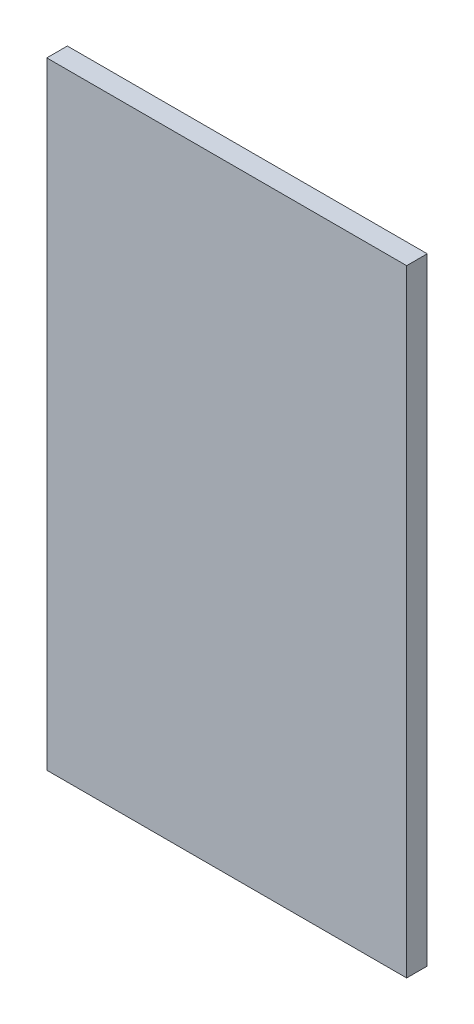
ISO-10303-21;
HEADER;
FILE_DESCRIPTION(('STEP AP214'),'2;1');
FILE_NAME('part.step','',(''),(''),'','','');
FILE_SCHEMA(('AUTOMOTIVE_DESIGN { 1 0 10303 214 1 1 1 1 }'));
ENDSEC;
DATA;
#1=APPLICATION_CONTEXT('core data for automotive mechanical design processes');
#2=APPLICATION_PROTOCOL_DEFINITION('international standard','automotive_design',2000,#1);
#3=PRODUCT_CONTEXT('',#1,'mechanical');
#4=PRODUCT('Part','Part','',(#3));
#5=PRODUCT_RELATED_PRODUCT_CATEGORY('part','',(#4));
#6=PRODUCT_DEFINITION_FORMATION('','',#4);
#7=PRODUCT_DEFINITION_CONTEXT('part definition',#1,'design');
#8=PRODUCT_DEFINITION('design','',#6,#7);
#9=PRODUCT_DEFINITION_SHAPE('','',#8);
#10=(LENGTH_UNIT() NAMED_UNIT(*) SI_UNIT(.MILLI.,.METRE.));
#11=(NAMED_UNIT(*) PLANE_ANGLE_UNIT() SI_UNIT($,.RADIAN.));
#12=(NAMED_UNIT(*) SI_UNIT($,.STERADIAN.) SOLID_ANGLE_UNIT());
#13=UNCERTAINTY_MEASURE_WITH_UNIT(LENGTH_MEASURE(1.E-05),#10,'distance_accuracy_value','');
#14=(GEOMETRIC_REPRESENTATION_CONTEXT(3) GLOBAL_UNCERTAINTY_ASSIGNED_CONTEXT((#13)) GLOBAL_UNIT_ASSIGNED_CONTEXT((#10,
#11,#12)) REPRESENTATION_CONTEXT('',''));
#15=CARTESIAN_POINT('',(0.,0.,0.));
#16=DIRECTION('',(0.,0.,1.));
#17=DIRECTION('',(1.,0.,0.));
#18=AXIS2_PLACEMENT_3D('',#15,#16,#17);
#19=CARTESIAN_POINT('',(87.5,150.,10.));
#20=DIRECTION('',(0.,-1.,0.));
#21=DIRECTION('',(0.,0.,-1.));
#22=AXIS2_PLACEMENT_3D('',#19,#20,#21);
#23=PLANE('',#22);
#24=DIRECTION('',(-1.,0.,0.));
#25=VECTOR('',#24,1.);
#26=CARTESIAN_POINT('',(87.5,150.,0.));
#27=LINE('',#26,#25);
#28=CARTESIAN_POINT('',(87.5,150.,0.));
#29=VERTEX_POINT('',#28);
#30=CARTESIAN_POINT('',(-87.5,150.,0.));
#31=VERTEX_POINT('',#30);
#32=EDGE_CURVE('E113',#29,#31,#27,.T.);
#33=ORIENTED_EDGE('',*,*,#32,.T.);
#34=DIRECTION('',(0.,0.,-1.));
#35=VECTOR('',#34,1.);
#36=CARTESIAN_POINT('',(-87.5,150.,10.));
#37=LINE('',#36,#35);
#38=CARTESIAN_POINT('',(-87.5,150.,10.));
#39=VERTEX_POINT('',#38);
#40=EDGE_CURVE('E11',#39,#31,#37,.T.);
#41=ORIENTED_EDGE('',*,*,#40,.F.);
#42=DIRECTION('',(-1.,0.,0.));
#43=VECTOR('',#42,1.);
#44=CARTESIAN_POINT('',(87.5,150.,10.));
#45=LINE('',#44,#43);
#46=CARTESIAN_POINT('',(87.5,150.,10.));
#47=VERTEX_POINT('',#46);
#48=EDGE_CURVE('E97',#47,#39,#45,.T.);
#49=ORIENTED_EDGE('',*,*,#48,.F.);
#50=DIRECTION('',(0.,0.,-1.));
#51=VECTOR('',#50,1.);
#52=CARTESIAN_POINT('',(87.5,150.,10.));
#53=LINE('',#52,#51);
#54=EDGE_CURVE('E109',#47,#29,#53,.T.);
#55=ORIENTED_EDGE('',*,*,#54,.T.);
#56=EDGE_LOOP('',(#33,#41,#49,#55));
#57=FACE_BOUND('',#56,.T.);
#58=ADVANCED_FACE('F45',(#57),#23,.F.);
#59=CARTESIAN_POINT('',(-87.5,-150.,10.));
#60=DIRECTION('',(1.,0.,0.));
#61=DIRECTION('',(0.,0.,-1.));
#62=AXIS2_PLACEMENT_3D('',#59,#60,#61);
#63=PLANE('',#62);
#64=DIRECTION('',(0.,-1.,0.));
#65=VECTOR('',#64,1.);
#66=CARTESIAN_POINT('',(-87.5,-150.,0.));
#67=LINE('',#66,#65);
#68=CARTESIAN_POINT('',(-87.5,-150.,0.));
#69=VERTEX_POINT('',#68);
#70=EDGE_CURVE('E102',#31,#69,#67,.T.);
#71=ORIENTED_EDGE('',*,*,#70,.T.);
#72=DIRECTION('',(0.,0.,-1.));
#73=VECTOR('',#72,1.);
#74=CARTESIAN_POINT('',(-87.5,-150.,10.));
#75=LINE('',#74,#73);
#76=CARTESIAN_POINT('',(-87.5,-150.,10.));
#77=VERTEX_POINT('',#76);
#78=EDGE_CURVE('E54',#77,#69,#75,.T.);
#79=ORIENTED_EDGE('',*,*,#78,.F.);
#80=DIRECTION('',(0.,-1.,0.));
#81=VECTOR('',#80,1.);
#82=CARTESIAN_POINT('',(-87.5,-150.,10.));
#83=LINE('',#82,#81);
#84=EDGE_CURVE('E92',#39,#77,#83,.T.);
#85=ORIENTED_EDGE('',*,*,#84,.F.);
#86=ORIENTED_EDGE('',*,*,#40,.T.);
#87=EDGE_LOOP('',(#71,#79,#85,#86));
#88=FACE_BOUND('',#87,.T.);
#89=ADVANCED_FACE('F101',(#88),#63,.F.);
#90=CARTESIAN_POINT('',(87.5,-150.,10.));
#91=DIRECTION('',(0.,1.,0.));
#92=DIRECTION('',(0.,0.,1.));
#93=AXIS2_PLACEMENT_3D('',#90,#91,#92);
#94=PLANE('',#93);
#95=DIRECTION('',(1.,0.,0.));
#96=VECTOR('',#95,1.);
#97=CARTESIAN_POINT('',(87.5,-150.,0.));
#98=LINE('',#97,#96);
#99=CARTESIAN_POINT('',(87.5,-150.,0.));
#100=VERTEX_POINT('',#99);
#101=EDGE_CURVE('E79',#69,#100,#98,.T.);
#102=ORIENTED_EDGE('',*,*,#101,.T.);
#103=DIRECTION('',(0.,0.,-1.));
#104=VECTOR('',#103,1.);
#105=CARTESIAN_POINT('',(87.5,-150.,10.));
#106=LINE('',#105,#104);
#107=CARTESIAN_POINT('',(87.5,-150.,10.));
#108=VERTEX_POINT('',#107);
#109=EDGE_CURVE('E104',#108,#100,#106,.T.);
#110=ORIENTED_EDGE('',*,*,#109,.F.);
#111=DIRECTION('',(1.,0.,0.));
#112=VECTOR('',#111,1.);
#113=CARTESIAN_POINT('',(87.5,-150.,10.));
#114=LINE('',#113,#112);
#115=EDGE_CURVE('E95',#77,#108,#114,.T.);
#116=ORIENTED_EDGE('',*,*,#115,.F.);
#117=ORIENTED_EDGE('',*,*,#78,.T.);
#118=EDGE_LOOP('',(#102,#110,#116,#117));
#119=FACE_BOUND('',#118,.T.);
#120=ADVANCED_FACE('F105',(#119),#94,.F.);
#121=CARTESIAN_POINT('',(87.5,-150.,10.));
#122=DIRECTION('',(-1.,0.,0.));
#123=DIRECTION('',(0.,0.,1.));
#124=AXIS2_PLACEMENT_3D('',#121,#122,#123);
#125=PLANE('',#124);
#126=DIRECTION('',(0.,1.,0.));
#127=VECTOR('',#126,1.);
#128=CARTESIAN_POINT('',(87.5,-150.,0.));
#129=LINE('',#128,#127);
#130=EDGE_CURVE('E85',#100,#29,#129,.T.);
#131=ORIENTED_EDGE('',*,*,#130,.T.);
#132=ORIENTED_EDGE('',*,*,#54,.F.);
#133=DIRECTION('',(0.,1.,0.));
#134=VECTOR('',#133,1.);
#135=CARTESIAN_POINT('',(87.5,-150.,10.));
#136=LINE('',#135,#134);
#137=EDGE_CURVE('E62',#108,#47,#136,.T.);
#138=ORIENTED_EDGE('',*,*,#137,.F.);
#139=ORIENTED_EDGE('',*,*,#109,.T.);
#140=EDGE_LOOP('',(#131,#132,#138,#139));
#141=FACE_BOUND('',#140,.T.);
#142=ADVANCED_FACE('F126',(#141),#125,.F.);
#143=CARTESIAN_POINT('',(0.,0.,10.));
#144=DIRECTION('',(0.,0.,-1.));
#145=DIRECTION('',(-1.,0.,0.));
#146=AXIS2_PLACEMENT_3D('',#143,#144,#145);
#147=PLANE('',#146);
#148=ORIENTED_EDGE('',*,*,#48,.T.);
#149=ORIENTED_EDGE('',*,*,#84,.T.);
#150=ORIENTED_EDGE('',*,*,#115,.T.);
#151=ORIENTED_EDGE('',*,*,#137,.T.);
#152=EDGE_LOOP('',(#148,#149,#150,#151));
#153=FACE_BOUND('',#152,.T.);
#154=ADVANCED_FACE('F93',(#153),#147,.F.);
#155=CARTESIAN_POINT('',(0.,0.,0.));
#156=DIRECTION('',(0.,0.,-1.));
#157=DIRECTION('',(-1.,0.,0.));
#158=AXIS2_PLACEMENT_3D('',#155,#156,#157);
#159=PLANE('',#158);
#160=ORIENTED_EDGE('',*,*,#32,.F.);
#161=ORIENTED_EDGE('',*,*,#130,.F.);
#162=ORIENTED_EDGE('',*,*,#101,.F.);
#163=ORIENTED_EDGE('',*,*,#70,.F.);
#164=EDGE_LOOP('',(#160,#161,#162,#163));
#165=FACE_BOUND('',#164,.T.);
#166=ADVANCED_FACE('F129',(#165),#159,.T.);
#167=CLOSED_SHELL('',(#58,#89,#120,#142,#154,#166));
#168=MANIFOLD_SOLID_BREP('B2',#167);
#169=ADVANCED_BREP_SHAPE_REPRESENTATION('',(#18,#168),#14);
#170=SHAPE_DEFINITION_REPRESENTATION(#9,#169);
ENDSEC;
END-ISO-10303-21;
